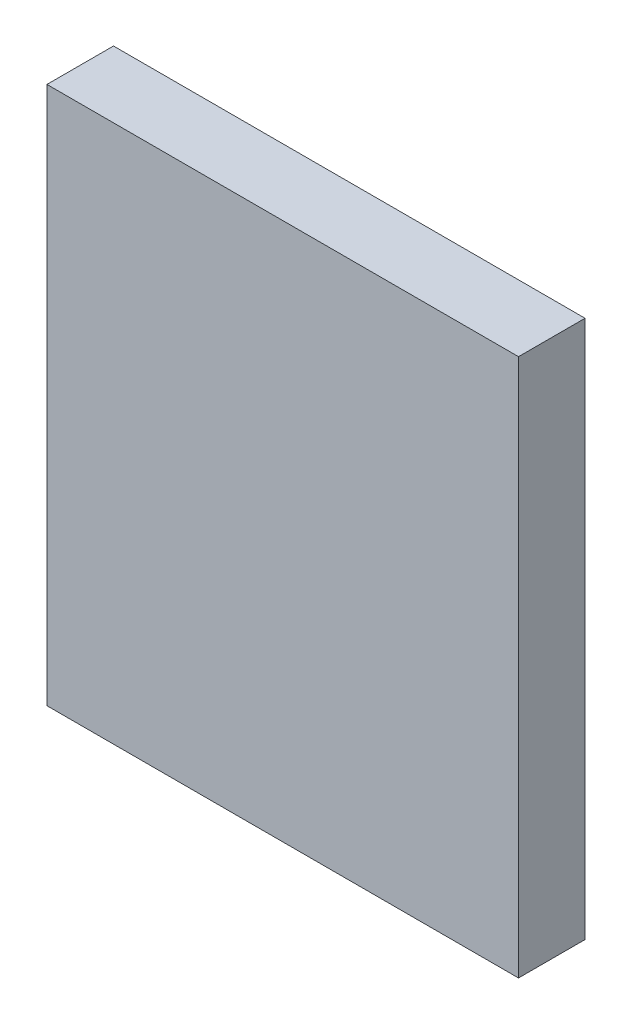
ISO-10303-21;
HEADER;
FILE_DESCRIPTION(('STEP AP214'),'2;1');
FILE_NAME('part.step','',(''),(''),'','','');
FILE_SCHEMA(('AUTOMOTIVE_DESIGN { 1 0 10303 214 1 1 1 1 }'));
ENDSEC;
DATA;
#1=APPLICATION_CONTEXT('core data for automotive mechanical design processes');
#2=APPLICATION_PROTOCOL_DEFINITION('international standard','automotive_design',2000,#1);
#3=PRODUCT_CONTEXT('',#1,'mechanical');
#4=PRODUCT('Part','Part','',(#3));
#5=PRODUCT_RELATED_PRODUCT_CATEGORY('part','',(#4));
#6=PRODUCT_DEFINITION_FORMATION('','',#4);
#7=PRODUCT_DEFINITION_CONTEXT('part definition',#1,'design');
#8=PRODUCT_DEFINITION('design','',#6,#7);
#9=PRODUCT_DEFINITION_SHAPE('','',#8);
#10=(LENGTH_UNIT() NAMED_UNIT(*) SI_UNIT(.MILLI.,.METRE.));
#11=(NAMED_UNIT(*) PLANE_ANGLE_UNIT() SI_UNIT($,.RADIAN.));
#12=(NAMED_UNIT(*) SI_UNIT($,.STERADIAN.) SOLID_ANGLE_UNIT());
#13=UNCERTAINTY_MEASURE_WITH_UNIT(LENGTH_MEASURE(1.E-05),#10,'distance_accuracy_value','');
#14=(GEOMETRIC_REPRESENTATION_CONTEXT(3) GLOBAL_UNCERTAINTY_ASSIGNED_CONTEXT((#13)) GLOBAL_UNIT_ASSIGNED_CONTEXT((#10,
#11,#12)) REPRESENTATION_CONTEXT('',''));
#15=CARTESIAN_POINT('',(0.,0.,0.));
#16=DIRECTION('',(0.,0.,1.));
#17=DIRECTION('',(1.,0.,0.));
#18=AXIS2_PLACEMENT_3D('',#15,#16,#17);
#19=CARTESIAN_POINT('',(8.1499964,-9.29999918,2.30000048));
#20=DIRECTION('',(0.,0.,1.));
#21=DIRECTION('',(1.,0.,0.));
#22=AXIS2_PLACEMENT_3D('',#19,#20,#21);
#23=PLANE('',#22);
#24=DIRECTION('',(-1.,0.,0.));
#25=VECTOR('',#24,1.);
#26=CARTESIAN_POINT('',(8.1499964,-9.29999918,2.30000048));
#27=LINE('',#26,#25);
#28=CARTESIAN_POINT('',(8.1499964,-9.29999918,2.30000048));
#29=VERTEX_POINT('',#28);
#30=CARTESIAN_POINT('',(-8.15000148,-9.29999918,2.30000048));
#31=VERTEX_POINT('',#30);
#32=EDGE_CURVE('E98',#29,#31,#27,.T.);
#33=ORIENTED_EDGE('',*,*,#32,.F.);
#34=DIRECTION('',(-1.36559151759699E-07,-1.,0.));
#35=VECTOR('',#34,1.);
#36=CARTESIAN_POINT('',(8.14999894,9.29999918,2.30000048));
#37=LINE('',#36,#35);
#38=CARTESIAN_POINT('',(8.14999894,9.29999918,2.30000048));
#39=VERTEX_POINT('',#38);
#40=EDGE_CURVE('E28',#39,#29,#37,.T.);
#41=ORIENTED_EDGE('',*,*,#40,.F.);
#42=DIRECTION('',(1.,0.,0.));
#43=VECTOR('',#42,1.);
#44=CARTESIAN_POINT('',(-8.14999894,9.29999918,2.30000048));
#45=LINE('',#44,#43);
#46=CARTESIAN_POINT('',(-8.14999894,9.29999918,2.30000048));
#47=VERTEX_POINT('',#46);
#48=EDGE_CURVE('E86',#47,#39,#45,.T.);
#49=ORIENTED_EDGE('',*,*,#48,.F.);
#50=DIRECTION('',(1.36559151855199E-07,1.,0.));
#51=VECTOR('',#50,1.);
#52=CARTESIAN_POINT('',(-8.15000148,-9.29999918,2.30000048));
#53=LINE('',#52,#51);
#54=EDGE_CURVE('E89',#31,#47,#53,.T.);
#55=ORIENTED_EDGE('',*,*,#54,.F.);
#56=EDGE_LOOP('',(#33,#41,#49,#55));
#57=FACE_BOUND('',#56,.T.);
#58=ADVANCED_FACE('F17',(#57),#23,.T.);
#59=CARTESIAN_POINT('',(8.1499964,-9.29999918,0.));
#60=DIRECTION('',(0.,0.,1.));
#61=DIRECTION('',(1.,0.,0.));
#62=AXIS2_PLACEMENT_3D('',#59,#60,#61);
#63=PLANE('',#62);
#64=DIRECTION('',(-1.,0.,0.));
#65=VECTOR('',#64,1.);
#66=CARTESIAN_POINT('',(8.1499964,-9.29999918,0.));
#67=LINE('',#66,#65);
#68=CARTESIAN_POINT('',(8.1499964,-9.29999918,0.));
#69=VERTEX_POINT('',#68);
#70=CARTESIAN_POINT('',(-8.15000148,-9.29999918,0.));
#71=VERTEX_POINT('',#70);
#72=EDGE_CURVE('E81',#69,#71,#67,.T.);
#73=ORIENTED_EDGE('',*,*,#72,.T.);
#74=DIRECTION('',(1.36559151855199E-07,1.,0.));
#75=VECTOR('',#74,1.);
#76=CARTESIAN_POINT('',(-8.15000148,-9.29999918,0.));
#77=LINE('',#76,#75);
#78=CARTESIAN_POINT('',(-8.14999894,9.29999918,0.));
#79=VERTEX_POINT('',#78);
#80=EDGE_CURVE('E78',#71,#79,#77,.T.);
#81=ORIENTED_EDGE('',*,*,#80,.T.);
#82=DIRECTION('',(1.,0.,0.));
#83=VECTOR('',#82,1.);
#84=CARTESIAN_POINT('',(-8.14999894,9.29999918,0.));
#85=LINE('',#84,#83);
#86=CARTESIAN_POINT('',(8.14999894,9.29999918,0.));
#87=VERTEX_POINT('',#86);
#88=EDGE_CURVE('E21',#79,#87,#85,.T.);
#89=ORIENTED_EDGE('',*,*,#88,.T.);
#90=DIRECTION('',(-1.36559151759699E-07,-1.,0.));
#91=VECTOR('',#90,1.);
#92=CARTESIAN_POINT('',(8.14999894,9.29999918,0.));
#93=LINE('',#92,#91);
#94=EDGE_CURVE('E11',#87,#69,#93,.T.);
#95=ORIENTED_EDGE('',*,*,#94,.T.);
#96=EDGE_LOOP('',(#73,#81,#89,#95));
#97=FACE_BOUND('',#96,.T.);
#98=ADVANCED_FACE('F79',(#97),#63,.F.);
#99=CARTESIAN_POINT('',(8.14999894,9.29999918,0.));
#100=DIRECTION('',(1.,-1.36559151759699E-07,0.));
#101=DIRECTION('',(0.,0.,-1.));
#102=AXIS2_PLACEMENT_3D('',#99,#100,#101);
#103=PLANE('',#102);
#104=DIRECTION('',(0.,0.,1.));
#105=VECTOR('',#104,1.);
#106=CARTESIAN_POINT('',(8.14999894,9.29999918,0.));
#107=LINE('',#106,#105);
#108=EDGE_CURVE('E74',#87,#39,#107,.T.);
#109=ORIENTED_EDGE('',*,*,#108,.T.);
#110=ORIENTED_EDGE('',*,*,#40,.T.);
#111=DIRECTION('',(0.,0.,1.));
#112=VECTOR('',#111,1.);
#113=CARTESIAN_POINT('',(8.1499964,-9.29999918,0.));
#114=LINE('',#113,#112);
#115=EDGE_CURVE('E103',#69,#29,#114,.T.);
#116=ORIENTED_EDGE('',*,*,#115,.F.);
#117=ORIENTED_EDGE('',*,*,#94,.F.);
#118=EDGE_LOOP('',(#109,#110,#116,#117));
#119=FACE_BOUND('',#118,.T.);
#120=ADVANCED_FACE('F116',(#119),#103,.T.);
#121=CARTESIAN_POINT('',(-8.14999894,9.29999918,0.));
#122=DIRECTION('',(0.,1.,0.));
#123=DIRECTION('',(1.,0.,0.));
#124=AXIS2_PLACEMENT_3D('',#121,#122,#123);
#125=PLANE('',#124);
#126=DIRECTION('',(0.,0.,1.));
#127=VECTOR('',#126,1.);
#128=CARTESIAN_POINT('',(-8.14999894,9.29999918,0.));
#129=LINE('',#128,#127);
#130=EDGE_CURVE('E72',#79,#47,#129,.T.);
#131=ORIENTED_EDGE('',*,*,#130,.T.);
#132=ORIENTED_EDGE('',*,*,#48,.T.);
#133=ORIENTED_EDGE('',*,*,#108,.F.);
#134=ORIENTED_EDGE('',*,*,#88,.F.);
#135=EDGE_LOOP('',(#131,#132,#133,#134));
#136=FACE_BOUND('',#135,.T.);
#137=ADVANCED_FACE('F69',(#136),#125,.T.);
#138=CARTESIAN_POINT('',(-8.15000148,-9.29999918,0.));
#139=DIRECTION('',(-1.,1.36559151855199E-07,0.));
#140=DIRECTION('',(0.,0.,1.));
#141=AXIS2_PLACEMENT_3D('',#138,#139,#140);
#142=PLANE('',#141);
#143=DIRECTION('',(0.,0.,1.));
#144=VECTOR('',#143,1.);
#145=CARTESIAN_POINT('',(-8.15000148,-9.29999918,0.));
#146=LINE('',#145,#144);
#147=EDGE_CURVE('E102',#71,#31,#146,.T.);
#148=ORIENTED_EDGE('',*,*,#147,.T.);
#149=ORIENTED_EDGE('',*,*,#54,.T.);
#150=ORIENTED_EDGE('',*,*,#130,.F.);
#151=ORIENTED_EDGE('',*,*,#80,.F.);
#152=EDGE_LOOP('',(#148,#149,#150,#151));
#153=FACE_BOUND('',#152,.T.);
#154=ADVANCED_FACE('F88',(#153),#142,.T.);
#155=CARTESIAN_POINT('',(8.1499964,-9.29999918,0.));
#156=DIRECTION('',(0.,-1.,0.));
#157=DIRECTION('',(0.,0.,-1.));
#158=AXIS2_PLACEMENT_3D('',#155,#156,#157);
#159=PLANE('',#158);
#160=ORIENTED_EDGE('',*,*,#115,.T.);
#161=ORIENTED_EDGE('',*,*,#32,.T.);
#162=ORIENTED_EDGE('',*,*,#147,.F.);
#163=ORIENTED_EDGE('',*,*,#72,.F.);
#164=EDGE_LOOP('',(#160,#161,#162,#163));
#165=FACE_BOUND('',#164,.T.);
#166=ADVANCED_FACE('F19',(#165),#159,.T.);
#167=CLOSED_SHELL('',(#58,#98,#120,#137,#154,#166));
#168=MANIFOLD_SOLID_BREP('B1',#167);
#169=ADVANCED_BREP_SHAPE_REPRESENTATION('',(#18,#168),#14);
#170=SHAPE_DEFINITION_REPRESENTATION(#9,#169);
ENDSEC;
END-ISO-10303-21;
